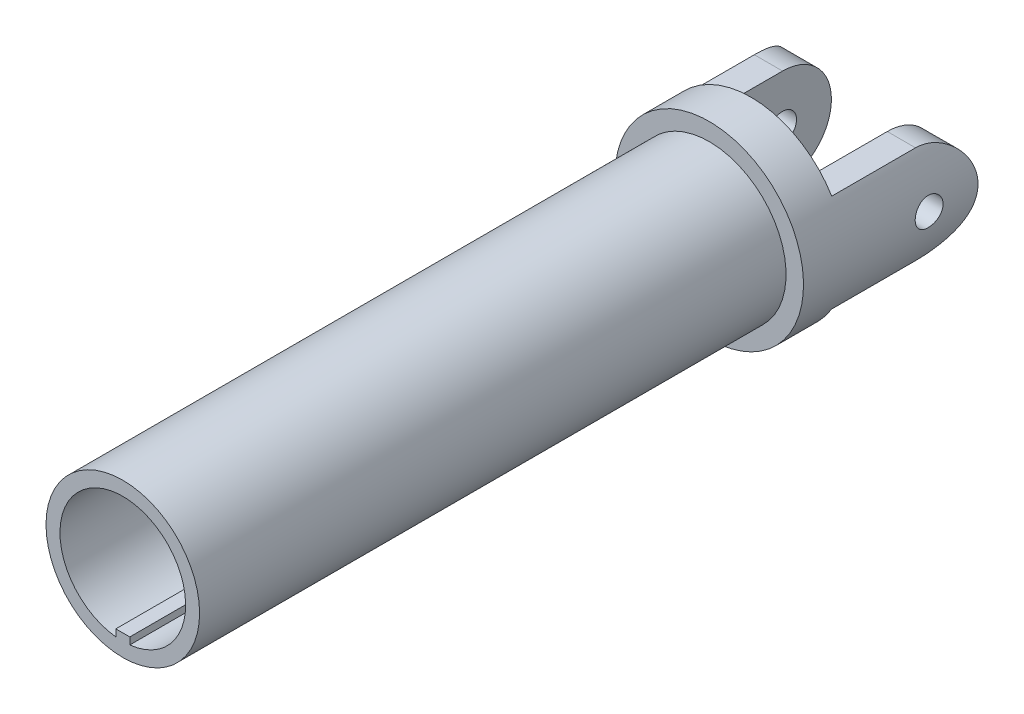
ISO-10303-21;
HEADER;
FILE_DESCRIPTION(('STEP AP214'),'2;1');
FILE_NAME('part.step','',(''),(''),'','','');
FILE_SCHEMA(('AUTOMOTIVE_DESIGN { 1 0 10303 214 1 1 1 1 }'));
ENDSEC;
DATA;
#1=APPLICATION_CONTEXT('core data for automotive mechanical design processes');
#2=APPLICATION_PROTOCOL_DEFINITION('international standard','automotive_design',2000,#1);
#3=PRODUCT_CONTEXT('',#1,'mechanical');
#4=PRODUCT('Part','Part','',(#3));
#5=PRODUCT_RELATED_PRODUCT_CATEGORY('part','',(#4));
#6=PRODUCT_DEFINITION_FORMATION('','',#4);
#7=PRODUCT_DEFINITION_CONTEXT('part definition',#1,'design');
#8=PRODUCT_DEFINITION('design','',#6,#7);
#9=PRODUCT_DEFINITION_SHAPE('','',#8);
#10=(LENGTH_UNIT() NAMED_UNIT(*) SI_UNIT(.MILLI.,.METRE.));
#11=(NAMED_UNIT(*) PLANE_ANGLE_UNIT() SI_UNIT($,.RADIAN.));
#12=(NAMED_UNIT(*) SI_UNIT($,.STERADIAN.) SOLID_ANGLE_UNIT());
#13=UNCERTAINTY_MEASURE_WITH_UNIT(LENGTH_MEASURE(1.E-05),#10,'distance_accuracy_value','');
#14=(GEOMETRIC_REPRESENTATION_CONTEXT(3) GLOBAL_UNCERTAINTY_ASSIGNED_CONTEXT((#13)) GLOBAL_UNIT_ASSIGNED_CONTEXT((#10,
#11,#12)) REPRESENTATION_CONTEXT('',''));
#15=CARTESIAN_POINT('',(0.,0.,0.));
#16=DIRECTION('',(0.,0.,1.));
#17=DIRECTION('',(1.,0.,0.));
#18=AXIS2_PLACEMENT_3D('',#15,#16,#17);
#19=CARTESIAN_POINT('',(0.,0.,-24.));
#20=DIRECTION('',(0.,0.,1.));
#21=DIRECTION('',(1.,0.,0.));
#22=AXIS2_PLACEMENT_3D('',#19,#20,#21);
#23=CYLINDRICAL_SURFACE('',#22,6.75);
#24=CARTESIAN_POINT('',(-6.75,0.,-31.));
#25=CARTESIAN_POINT('',(-6.74999911272059,0.0558425409101657,-30.9999976909739));
#26=CARTESIAN_POINT('',(-6.74929975767196,0.111717684844449,-30.9953066262002));
#27=CARTESIAN_POINT('',(-6.74657719642042,0.221906738606192,-30.9766707451346));
#28=CARTESIAN_POINT('',(-6.74455269374564,0.276219065053058,-30.9627168662834));
#29=CARTESIAN_POINT('',(-6.73940739080019,0.381671836837064,-30.9259809826003));
#30=CARTESIAN_POINT('',(-6.73628741208205,0.432814625447509,-30.9032055921468));
#31=CARTESIAN_POINT('',(-6.72929609307386,0.530544531243023,-30.8494892287142));
#32=CARTESIAN_POINT('',(-6.72542485910577,0.577132291680521,-30.8185494109893));
#33=CARTESIAN_POINT('',(-6.71732864075089,0.66479301775161,-30.7491309350935));
#34=CARTESIAN_POINT('',(-6.71310142384377,0.705826205517572,-30.7106023010483));
#35=CARTESIAN_POINT('',(-6.70478718892022,0.780869855713781,-30.6272074094649));
#36=CARTESIAN_POINT('',(-6.70070017890102,0.81487991810721,-30.5823407911604));
#37=CARTESIAN_POINT('',(-6.69310742202681,0.875066235908764,-30.4872769283577));
#38=CARTESIAN_POINT('',(-6.6896045599627,0.901204098047282,-30.4370551261348));
#39=CARTESIAN_POINT('',(-6.68360711396161,0.944658716040232,-30.3328737482525));
#40=CARTESIAN_POINT('',(-6.68111247643255,0.96197594076768,-30.2789143714423));
#41=CARTESIAN_POINT('',(-6.67743583632494,0.987174376659307,-30.1692074990302));
#42=CARTESIAN_POINT('',(-6.67624437438597,0.995123620308464,-30.1134759525087));
#43=CARTESIAN_POINT('',(-6.67528025275461,1.0015711832689,-30.0014582086667));
#44=CARTESIAN_POINT('',(-6.67550751356993,1.00007003209414,-29.9451720425985));
#45=CARTESIAN_POINT('',(-6.67734650914669,0.987715034694439,-29.834122886774));
#46=CARTESIAN_POINT('',(-6.67894703709383,0.976936892914968,-29.7793512620758));
#47=CARTESIAN_POINT('',(-6.68333472365175,0.946452342629806,-29.6724025809788));
#48=CARTESIAN_POINT('',(-6.68612191507621,0.926745687231395,-29.6202255963716));
#49=CARTESIAN_POINT('',(-6.69258128775432,0.878884561850782,-29.5197165856181));
#50=CARTESIAN_POINT('',(-6.69625682457254,0.85069795915564,-29.4714000851476));
#51=CARTESIAN_POINT('',(-6.70407630948204,0.78669994549834,-29.3801539640613));
#52=CARTESIAN_POINT('',(-6.70822028756469,0.750888046206288,-29.3372246887274));
#53=CARTESIAN_POINT('',(-6.71655927335414,0.672240133725879,-29.2575328147743));
#54=CARTESIAN_POINT('',(-6.7207543845646,0.62933901893079,-29.2208344453194));
#55=CARTESIAN_POINT('',(-6.72868539581363,0.53795254497229,-29.155148804508));
#56=CARTESIAN_POINT('',(-6.73242129392949,0.489467162429428,-29.126161565437));
#57=CARTESIAN_POINT('',(-6.73901671048289,0.38823329363178,-29.0767179850269));
#58=CARTESIAN_POINT('',(-6.74187572726903,0.335482388854871,-29.0562665244811));
#59=CARTESIAN_POINT('',(-6.74639102909035,0.22724304161698,-29.0245304925167));
#60=CARTESIAN_POINT('',(-6.74804739342113,0.171754779898362,-29.0132453167232));
#61=CARTESIAN_POINT('',(-6.74996027662796,0.0601702510974135,-29.000247433234));
#62=CARTESIAN_POINT('',(-6.75022971002842,0.00408448467763341,-28.9984464094182));
#63=CARTESIAN_POINT('',(-6.74937350522533,-0.107588256207567,-29.0042336439311));
#64=CARTESIAN_POINT('',(-6.74824790911938,-0.163175245673516,-29.0118216189294));
#65=CARTESIAN_POINT('',(-6.74473610882736,-0.272005564748215,-29.0360980220436));
#66=CARTESIAN_POINT('',(-6.74235585630278,-0.32525868441956,-29.0527434964207));
#67=CARTESIAN_POINT('',(-6.73660080136599,-0.428218204093146,-29.0946171488986));
#68=CARTESIAN_POINT('',(-6.73322595324427,-0.477924440957681,-29.1198457214687));
#69=CARTESIAN_POINT('',(-6.72582473545489,-0.572768052310924,-29.1783771366065));
#70=CARTESIAN_POINT('',(-6.72179390576589,-0.617870444216266,-29.2117360902563));
#71=CARTESIAN_POINT('',(-6.71354345616816,-0.70186815594721,-29.2855031079937));
#72=CARTESIAN_POINT('',(-6.70932382558081,-0.740763124109862,-29.3259115711788));
#73=CARTESIAN_POINT('',(-6.70113048938946,-0.811562616638171,-29.4130234049341));
#74=CARTESIAN_POINT('',(-6.69715905164284,-0.843407990393647,-29.4597750953769));
#75=CARTESIAN_POINT('',(-6.68995170503097,-0.898793373321402,-29.5580159613304));
#76=CARTESIAN_POINT('',(-6.68671577667948,-0.922333602535498,-29.6095050112808));
#77=CARTESIAN_POINT('',(-6.68136217784517,-0.960348470530136,-29.7155814744695));
#78=CARTESIAN_POINT('',(-6.67924064990097,-0.974854414016819,-29.7701574657212));
#79=CARTESIAN_POINT('',(-6.67634573947977,-0.994488675177338,-29.8810047537763));
#80=CARTESIAN_POINT('',(-6.67557226638415,-0.999617623190394,-29.9372759363674));
#81=CARTESIAN_POINT('',(-6.67546436730878,-1.00033757943703,-30.0493267995347));
#82=CARTESIAN_POINT('',(-6.67611591022978,-0.996021584936615,-30.1051058913773));
#83=CARTESIAN_POINT('',(-6.67875416313144,-0.978173271070795,-30.2151356901121));
#84=CARTESIAN_POINT('',(-6.68074087117957,-0.964640965045214,-30.2693863992164));
#85=CARTESIAN_POINT('',(-6.6858207421393,-0.928776749344402,-30.3747947554377));
#86=CARTESIAN_POINT('',(-6.68891310765919,-0.906451180127706,-30.4259546006592));
#87=CARTESIAN_POINT('',(-6.69585685750153,-0.853643415012499,-30.5238174857813));
#88=CARTESIAN_POINT('',(-6.69970826624953,-0.823160956618997,-30.5705203821881));
#89=CARTESIAN_POINT('',(-6.70778131838235,-0.754566231345791,-30.658616385123));
#90=CARTESIAN_POINT('',(-6.7120060970762,-0.716385046344522,-30.6999555482106));
#91=CARTESIAN_POINT('',(-6.72032356595988,-0.633622295064078,-30.7756731917375));
#92=CARTESIAN_POINT('',(-6.72441622518943,-0.589039241744768,-30.810050050473));
#93=CARTESIAN_POINT('',(-6.73203333976492,-0.494457481821442,-30.8710314318147));
#94=CARTESIAN_POINT('',(-6.73555463068598,-0.444431017911157,-30.897593290153));
#95=CARTESIAN_POINT('',(-6.74160116950649,-0.340598638239511,-30.9418980659904));
#96=CARTESIAN_POINT('',(-6.74412745252672,-0.28679671917619,-30.9596501534456));
#97=CARTESIAN_POINT('',(-6.7473200627825,-0.193958660761502,-30.9817862974269));
#98=CARTESIAN_POINT('',(-6.74831989929762,-0.155496645397279,-30.9886060480908));
#99=CARTESIAN_POINT('',(-6.74966017396957,-0.0780283890929527,-30.9977136790094));
#100=CARTESIAN_POINT('',(-6.75000062002111,-0.0390221546742607,-31.0000016135221));
#101=CARTESIAN_POINT('',(-6.75,0.,-31.));
#102=B_SPLINE_CURVE_WITH_KNOTS('',3,(#24,#25,#26,#27,#28,#29,#30,#31,#32,#33,#34,#35,#36,#37,
#38,#39,#40,#41,#42,#43,#44,#45,#46,#47,#48,#49,#50,#51,#52,#53,#54,#55,#56,#57,#58,#59,#60,#61,
#62,#63,#64,#65,#66,#67,#68,#69,#70,#71,#72,#73,#74,#75,#76,#77,#78,#79,#80,#81,#82,#83,#84,#85,
#86,#87,#88,#89,#90,#91,#92,#93,#94,#95,#96,#97,#98,#99,#100,#101),.UNSPECIFIED.,.T.,.F.,(4,2,2,
2,2,2,2,2,2,2,2,2,2,2,2,2,2,2,2,2,2,2,2,2,2,2,2,2,2,2,2,2,2,2,2,2,2,2,4),(0.,0.167385036095001,
0.33493408033917,0.502357738579202,0.669757719315227,0.838299369512641,1.00685061718639,
1.17621106378315,1.34556250685453,1.51367634882374,1.68178077130974,1.84852625275946,
2.01527634536397,2.18266643054019,2.35006723873285,2.51910075696945,2.6881349829183,
2.85726573135219,3.02638532731912,3.19392726588316,3.36146414868354,3.52821335257178,
3.6949702210977,3.86291226368386,4.03086381714738,4.20017525181088,4.36948220029192,
4.53819917064466,4.70690479910917,4.87395678992066,5.04100853893917,5.20794005372038,
5.37487694113277,5.54338046523498,5.71192319321397,5.88136966036332,6.05063938138702,
6.16760760787006,6.28457443391695),.UNSPECIFIED.);
#103=CARTESIAN_POINT('',(-6.75,0.,-31.));
#104=VERTEX_POINT('',#103);
#105=EDGE_CURVE('E211',#104,#104,#102,.T.);
#106=ORIENTED_EDGE('',*,*,#105,.T.);
#107=EDGE_LOOP('',(#106));
#108=FACE_BOUND('',#107,.T.);
#109=CARTESIAN_POINT('',(6.75,0.,-31.));
#110=CARTESIAN_POINT('',(6.74999911272059,-0.055842540910166,-30.9999976909739));
#111=CARTESIAN_POINT('',(6.74929975767196,-0.111717684844449,-30.9953066262002));
#112=CARTESIAN_POINT('',(6.74657719642042,-0.221906738606192,-30.9766707451346));
#113=CARTESIAN_POINT('',(6.74455269374564,-0.276219065053059,-30.9627168662834));
#114=CARTESIAN_POINT('',(6.73940739080019,-0.381671836837066,-30.9259809826003));
#115=CARTESIAN_POINT('',(6.73628741208205,-0.432814625447512,-30.9032055921468));
#116=CARTESIAN_POINT('',(6.72929609307386,-0.530544531243025,-30.8494892287142));
#117=CARTESIAN_POINT('',(6.72542485910577,-0.577132291680523,-30.8185494109893));
#118=CARTESIAN_POINT('',(6.71732864075089,-0.66479301775161,-30.7491309350935));
#119=CARTESIAN_POINT('',(6.71310142384377,-0.705826205517571,-30.7106023010483));
#120=CARTESIAN_POINT('',(6.70478718892022,-0.78086985571378,-30.6272074094649));
#121=CARTESIAN_POINT('',(6.70070017890102,-0.814879918107209,-30.5823407911604));
#122=CARTESIAN_POINT('',(6.69310742202681,-0.875066235908765,-30.4872769283577));
#123=CARTESIAN_POINT('',(6.6896045599627,-0.901204098047283,-30.4370551261348));
#124=CARTESIAN_POINT('',(6.68360711396162,-0.944658716040233,-30.3328737482525));
#125=CARTESIAN_POINT('',(6.68111247643255,-0.961975940767681,-30.2789143714423));
#126=CARTESIAN_POINT('',(6.67743583632494,-0.987174376659308,-30.1692074990302));
#127=CARTESIAN_POINT('',(6.67624437438597,-0.995123620308465,-30.1134759525087));
#128=CARTESIAN_POINT('',(6.67528025275461,-1.0015711832689,-30.0014582086667));
#129=CARTESIAN_POINT('',(6.67550751356993,-1.00007003209414,-29.9451720425985));
#130=CARTESIAN_POINT('',(6.67734650914669,-0.98771503469444,-29.834122886774));
#131=CARTESIAN_POINT('',(6.67894703709383,-0.976936892914969,-29.7793512620758));
#132=CARTESIAN_POINT('',(6.68333472365175,-0.946452342629807,-29.6724025809788));
#133=CARTESIAN_POINT('',(6.68612191507621,-0.926745687231397,-29.6202255963716));
#134=CARTESIAN_POINT('',(6.69258128775432,-0.878884561850785,-29.5197165856181));
#135=CARTESIAN_POINT('',(6.69625682457254,-0.850697959155643,-29.4714000851476));
#136=CARTESIAN_POINT('',(6.70407630948204,-0.786699945498343,-29.3801539640613));
#137=CARTESIAN_POINT('',(6.70822028756469,-0.75088804620629,-29.3372246887274));
#138=CARTESIAN_POINT('',(6.71655927335414,-0.67224013372588,-29.2575328147743));
#139=CARTESIAN_POINT('',(6.7207543845646,-0.629339018930791,-29.2208344453194));
#140=CARTESIAN_POINT('',(6.72868539581363,-0.537952544972292,-29.155148804508));
#141=CARTESIAN_POINT('',(6.73242129392949,-0.48946716242943,-29.126161565437));
#142=CARTESIAN_POINT('',(6.73901671048289,-0.388233293631784,-29.0767179850269));
#143=CARTESIAN_POINT('',(6.74187572726903,-0.335482388854875,-29.0562665244811));
#144=CARTESIAN_POINT('',(6.74639102909035,-0.227243041616984,-29.0245304925167));
#145=CARTESIAN_POINT('',(6.74804739342113,-0.171754779898365,-29.0132453167232));
#146=CARTESIAN_POINT('',(6.74996027662796,-0.060170251097415,-29.000247433234));
#147=CARTESIAN_POINT('',(6.75022971002842,-0.00408448467763501,-28.9984464094182));
#148=CARTESIAN_POINT('',(6.74937350522533,0.107588256207566,-29.0042336439311));
#149=CARTESIAN_POINT('',(6.74824790911938,0.163175245673515,-29.0118216189294));
#150=CARTESIAN_POINT('',(6.74473610882736,0.272005564748213,-29.0360980220436));
#151=CARTESIAN_POINT('',(6.74235585630278,0.32525868441956,-29.0527434964207));
#152=CARTESIAN_POINT('',(6.736600801366,0.428218204093145,-29.0946171488986));
#153=CARTESIAN_POINT('',(6.73322595324427,0.477924440957679,-29.1198457214687));
#154=CARTESIAN_POINT('',(6.72582473545489,0.572768052310921,-29.1783771366065));
#155=CARTESIAN_POINT('',(6.72179390576589,0.617870444216263,-29.2117360902563));
#156=CARTESIAN_POINT('',(6.71354345616816,0.701868155947209,-29.2855031079937));
#157=CARTESIAN_POINT('',(6.70932382558081,0.740763124109861,-29.3259115711788));
#158=CARTESIAN_POINT('',(6.70113048938946,0.811562616638169,-29.4130234049341));
#159=CARTESIAN_POINT('',(6.69715905164284,0.843407990393646,-29.4597750953769));
#160=CARTESIAN_POINT('',(6.68995170503097,0.898793373321402,-29.5580159613304));
#161=CARTESIAN_POINT('',(6.68671577667948,0.922333602535497,-29.6095050112808));
#162=CARTESIAN_POINT('',(6.68136217784517,0.960348470530135,-29.7155814744695));
#163=CARTESIAN_POINT('',(6.67924064990097,0.974854414016818,-29.7701574657212));
#164=CARTESIAN_POINT('',(6.67634573947977,0.994488675177337,-29.8810047537763));
#165=CARTESIAN_POINT('',(6.67557226638415,0.999617623190393,-29.9372759363674));
#166=CARTESIAN_POINT('',(6.67546436730878,1.00033757943703,-30.0493267995347));
#167=CARTESIAN_POINT('',(6.67611591022978,0.996021584936614,-30.1051058913773));
#168=CARTESIAN_POINT('',(6.67875416313144,0.978173271070794,-30.2151356901121));
#169=CARTESIAN_POINT('',(6.68074087117957,0.964640965045214,-30.2693863992164));
#170=CARTESIAN_POINT('',(6.6858207421393,0.928776749344403,-30.3747947554377));
#171=CARTESIAN_POINT('',(6.68891310765919,0.906451180127706,-30.4259546006592));
#172=CARTESIAN_POINT('',(6.69585685750153,0.853643415012498,-30.5238174857813));
#173=CARTESIAN_POINT('',(6.69970826624953,0.823160956618996,-30.5705203821881));
#174=CARTESIAN_POINT('',(6.70778131838235,0.75456623134579,-30.658616385123));
#175=CARTESIAN_POINT('',(6.7120060970762,0.716385046344521,-30.6999555482106));
#176=CARTESIAN_POINT('',(6.72032356595988,0.633622295064077,-30.7756731917375));
#177=CARTESIAN_POINT('',(6.72441622518943,0.589039241744767,-30.810050050473));
#178=CARTESIAN_POINT('',(6.73203333976492,0.494457481821442,-30.8710314318147));
#179=CARTESIAN_POINT('',(6.73555463068598,0.444431017911156,-30.897593290153));
#180=CARTESIAN_POINT('',(6.74160116950649,0.340598638239509,-30.9418980659904));
#181=CARTESIAN_POINT('',(6.74412745252672,0.286796719176189,-30.9596501534456));
#182=CARTESIAN_POINT('',(6.7473200627825,0.193958660761501,-30.9817862974269));
#183=CARTESIAN_POINT('',(6.74831989929762,0.155496645397279,-30.9886060480908));
#184=CARTESIAN_POINT('',(6.74966017396957,0.0780283890929522,-30.9977136790094));
#185=CARTESIAN_POINT('',(6.75000062002111,0.0390221546742602,-31.0000016135221));
#186=CARTESIAN_POINT('',(6.75,0.,-31.));
#187=B_SPLINE_CURVE_WITH_KNOTS('',3,(#109,#110,#111,#112,#113,#114,#115,#116,#117,#118,#119,
#120,#121,#122,#123,#124,#125,#126,#127,#128,#129,#130,#131,#132,#133,#134,#135,#136,#137,#138,
#139,#140,#141,#142,#143,#144,#145,#146,#147,#148,#149,#150,#151,#152,#153,#154,#155,#156,#157,
#158,#159,#160,#161,#162,#163,#164,#165,#166,#167,#168,#169,#170,#171,#172,#173,#174,#175,#176,
#177,#178,#179,#180,#181,#182,#183,#184,#185,#186),.UNSPECIFIED.,.T.,.F.,(4,2,2,2,2,2,2,2,2,2,2,
2,2,2,2,2,2,2,2,2,2,2,2,2,2,2,2,2,2,2,2,2,2,2,2,2,2,2,4),(0.,0.167385036095001,0.33493408033917,
0.502357738579206,0.669757719315226,0.838299369512639,1.00685061718639,1.17621106378315,
1.34556250685453,1.51367634882374,1.68178077130974,1.84852625275946,2.01527634536397,
2.18266643054019,2.35006723873285,2.51910075696945,2.6881349829183,2.85726573135218,
3.02638532731912,3.19392726588316,3.36146414868354,3.52821335257178,3.69497022109769,
3.86291226368386,4.03086381714738,4.20017525181088,4.36948220029192,4.53819917064465,
4.70690479910917,4.87395678992066,5.04100853893916,5.20794005372038,5.37487694113277,
5.54338046523498,5.71192319321397,5.88136966036332,6.05063938138702,6.16760760787006,
6.28457443391695),.UNSPECIFIED.);
#188=CARTESIAN_POINT('',(6.75,0.,-31.));
#189=VERTEX_POINT('',#188);
#190=EDGE_CURVE('E203',#189,#189,#187,.T.);
#191=ORIENTED_EDGE('',*,*,#190,.T.);
#192=EDGE_LOOP('',(#191));
#193=FACE_BOUND('',#192,.T.);
#194=CARTESIAN_POINT('',(0.,0.,-21.));
#195=DIRECTION('',(0.,0.,-1.));
#196=DIRECTION('',(-1.,0.,0.));
#197=AXIS2_PLACEMENT_3D('',#194,#195,#196);
#198=CIRCLE('',#197,6.75);
#199=CARTESIAN_POINT('',(-6.75,0.,-21.));
#200=VERTEX_POINT('',#199);
#201=EDGE_CURVE('E281',#200,#200,#198,.T.);
#202=ORIENTED_EDGE('',*,*,#201,.T.);
#203=EDGE_LOOP('',(#202));
#204=FACE_BOUND('',#203,.T.);
#205=DIRECTION('',(0.,0.,1.));
#206=VECTOR('',#205,1.);
#207=CARTESIAN_POINT('',(5.7716981903076,-3.5,-33.5));
#208=LINE('',#207,#206);
#209=CARTESIAN_POINT('',(5.7716981903076,-3.5,-30.));
#210=VERTEX_POINT('',#209);
#211=CARTESIAN_POINT('',(5.7716981903076,-3.5,-24.));
#212=VERTEX_POINT('',#211);
#213=EDGE_CURVE('E279',#210,#212,#208,.T.);
#214=ORIENTED_EDGE('',*,*,#213,.F.);
#215=CARTESIAN_POINT('',(5.7716981903076,3.5,-30.));
#216=CARTESIAN_POINT('',(5.77166955421002,3.50001705554504,-30.0911296720306));
#217=CARTESIAN_POINT('',(5.77385573039002,3.49644148706506,-30.1822433063665));
#218=CARTESIAN_POINT('',(5.78244171296421,3.48223957213489,-30.3636602749527));
#219=CARTESIAN_POINT('',(5.78883869884604,3.47161794528503,-30.4539641106151));
#220=CARTESIAN_POINT('',(5.8055794457996,3.44354424311248,-30.6325588453453));
#221=CARTESIAN_POINT('',(5.81589880800477,3.4261343766198,-30.7208586824379));
#222=CARTESIAN_POINT('',(5.8400971794397,3.38472148424651,-30.8953846300326));
#223=CARTESIAN_POINT('',(5.85397664340042,3.36071761608779,-30.981610474084));
#224=CARTESIAN_POINT('',(5.90020187745128,3.27933331417957,-31.235939769041));
#225=CARTESIAN_POINT('',(5.93719387256824,3.21248677463199,-31.4002758228421));
#226=CARTESIAN_POINT('',(6.01931780913164,3.05583264232749,-31.7155181456973));
#227=CARTESIAN_POINT('',(6.06446323301233,2.96598691404088,-31.8664015428341));
#228=CARTESIAN_POINT('',(6.16264056776469,2.75660193180785,-32.1650012631881));
#229=CARTESIAN_POINT('',(6.21601685999561,2.63514101237681,-32.3112609853853));
#230=CARTESIAN_POINT('',(6.32186227552666,2.37001501026078,-32.5824506155107));
#231=CARTESIAN_POINT('',(6.37433103978394,2.22634135335381,-32.7073722474757));
#232=CARTESIAN_POINT('',(6.47713032509302,1.90767178791381,-32.9415319664244));
#233=CARTESIAN_POINT('',(6.52701273178549,1.73114219734409,-33.0489165521625));
#234=CARTESIAN_POINT('',(6.59252243494399,1.45268714248443,-33.1859746896809));
#235=CARTESIAN_POINT('',(6.61280630524951,1.35759448846737,-33.2276568912017));
#236=CARTESIAN_POINT('',(6.64970570263882,1.163471802756,-33.3025976795009));
#237=CARTESIAN_POINT('',(6.66632220054169,1.06444282128917,-33.3358584959144));
#238=CARTESIAN_POINT('',(6.70325793796902,0.808346178347377,-33.4092047876708));
#239=CARTESIAN_POINT('',(6.72066792574392,0.649032894259841,-33.4431472978045));
#240=CARTESIAN_POINT('',(6.74403968155987,0.326492109055723,-33.4885444837744));
#241=CARTESIAN_POINT('',(6.75000510269833,0.163265873799951,-33.5000063354468));
#242=CARTESIAN_POINT('',(6.74999426917082,-0.183363540953697,-33.4999928846737));
#243=CARTESIAN_POINT('',(6.74245762627459,-0.366777079930823,-33.4855203872262));
#244=CARTESIAN_POINT('',(6.71307969249925,-0.727990267216297,-33.4283413782657));
#245=CARTESIAN_POINT('',(6.6912304660912,-0.905786743819561,-33.3856192037591));
#246=CARTESIAN_POINT('',(6.63549697804145,-1.2502132149756,-33.2740853297312));
#247=CARTESIAN_POINT('',(6.60165505000524,-1.41688006807026,-33.2053653441941));
#248=CARTESIAN_POINT('',(6.52498977679903,-1.73608609268259,-33.0443390011146));
#249=CARTESIAN_POINT('',(6.482164616279,-1.88862239967496,-32.9520278754017));
#250=CARTESIAN_POINT('',(6.38822453662089,-2.18607698720936,-32.739804038613));
#251=CARTESIAN_POINT('',(6.33675608268062,-2.32989818981952,-32.6185118676454));
#252=CARTESIAN_POINT('',(6.23239813645147,-2.59619176957678,-32.3547805876641));
#253=CARTESIAN_POINT('',(6.17950732609221,-2.7186434979309,-32.2123212687008));
#254=CARTESIAN_POINT('',(6.07301991608375,-2.94930903512127,-31.8955441184375));
#255=CARTESIAN_POINT('',(6.01975168260832,-3.05540163910414,-31.7195419513625));
#256=CARTESIAN_POINT('',(5.94847215092401,-3.19073390424003,-31.4421572873764));
#257=CARTESIAN_POINT('',(5.92615721445445,-3.23186426667083,-31.3475092158008));
#258=CARTESIAN_POINT('',(5.88523085987807,-3.305804412711,-31.1542678064187));
#259=CARTESIAN_POINT('',(5.86661687095029,-3.33861997647863,-31.0556772647871));
#260=CARTESIAN_POINT('',(5.83770575121213,-3.38885286422883,-30.8786689773139));
#261=CARTESIAN_POINT('',(5.82648140039545,-3.40807647409248,-30.8009085732123));
#262=CARTESIAN_POINT('',(5.80698300904305,-3.44119398640323,-30.643907733566));
#263=CARTESIAN_POINT('',(5.7987082133648,-3.45508925307723,-30.5646676823145));
#264=CARTESIAN_POINT('',(5.7853283424933,-3.47744975957481,-30.4048182151242));
#265=CARTESIAN_POINT('',(5.78023664157441,-3.48589209290093,-30.3242044640658));
#266=CARTESIAN_POINT('',(5.77341130360068,-3.49717450838589,-30.1623968818766));
#267=CARTESIAN_POINT('',(5.77167969418554,-3.50001120785646,-30.0812027301436));
#268=CARTESIAN_POINT('',(5.7716981903076,-3.5,-30.));
#269=B_SPLINE_CURVE_WITH_KNOTS('',3,(#215,#216,#217,#218,#219,#220,#221,#222,#223,#224,#225,
#226,#227,#228,#229,#230,#231,#232,#233,#234,#235,#236,#237,#238,#239,#240,#241,#242,#243,#244,
#245,#246,#247,#248,#249,#250,#251,#252,#253,#254,#255,#256,#257,#258,#259,#260,#261,#262,#263,
#264,#265,#266,#267,#268),.UNSPECIFIED.,.F.,.F.,(4,2,2,2,2,2,2,2,2,2,2,2,2,2,2,2,2,2,2,2,2,2,2,
2,2,2,4),(0.,0.273266457469637,0.546350059803084,0.81776205077936,1.08920872642422,
1.63035056553494,2.17239556411608,2.76231271942997,3.35245815672482,3.98642701695891,
4.30339604861506,4.62028107199127,5.10968645463685,5.59893559342907,6.14841021668935,
6.69818975112102,7.24604761353161,7.7940162950224,8.37674582580402,8.9600353529228,
9.59334043484272,9.90972008307292,10.2258791880275,10.4683092152784,10.7106771311512,
10.9540566679023,11.1975830258738),.UNSPECIFIED.);
#270=CARTESIAN_POINT('',(5.7716981903076,3.5,-30.));
#271=VERTEX_POINT('',#270);
#272=EDGE_CURVE('E244',#271,#210,#269,.T.);
#273=ORIENTED_EDGE('',*,*,#272,.F.);
#274=DIRECTION('',(0.,0.,1.));
#275=VECTOR('',#274,1.);
#276=CARTESIAN_POINT('',(5.7716981903076,3.5,-33.5));
#277=LINE('',#276,#275);
#278=CARTESIAN_POINT('',(5.7716981903076,3.5,-24.));
#279=VERTEX_POINT('',#278);
#280=EDGE_CURVE('E273',#271,#279,#277,.T.);
#281=ORIENTED_EDGE('',*,*,#280,.T.);
#282=CARTESIAN_POINT('',(0.,0.,-24.));
#283=DIRECTION('',(0.,0.,-1.));
#284=DIRECTION('',(-1.,0.,0.));
#285=AXIS2_PLACEMENT_3D('',#282,#283,#284);
#286=CIRCLE('',#285,6.75);
#287=CARTESIAN_POINT('',(-5.7716981903076,3.5,-24.));
#288=VERTEX_POINT('',#287);
#289=EDGE_CURVE('E285',#288,#279,#286,.T.);
#290=ORIENTED_EDGE('',*,*,#289,.F.);
#291=DIRECTION('',(0.,0.,1.));
#292=VECTOR('',#291,1.);
#293=CARTESIAN_POINT('',(-5.7716981903076,3.5,-33.5));
#294=LINE('',#293,#292);
#295=CARTESIAN_POINT('',(-5.7716981903076,3.5,-30.));
#296=VERTEX_POINT('',#295);
#297=EDGE_CURVE('E262',#296,#288,#294,.T.);
#298=ORIENTED_EDGE('',*,*,#297,.F.);
#299=CARTESIAN_POINT('',(-5.7716981903076,-3.5,-30.));
#300=CARTESIAN_POINT('',(-5.77166955421002,-3.50001705554504,-30.0911296720306));
#301=CARTESIAN_POINT('',(-5.77385573039002,-3.49644148706506,-30.1822433063665));
#302=CARTESIAN_POINT('',(-5.78244171296421,-3.48223957213489,-30.3636602749527));
#303=CARTESIAN_POINT('',(-5.78883869884604,-3.47161794528503,-30.4539641106151));
#304=CARTESIAN_POINT('',(-5.8055794457996,-3.44354424311248,-30.6325588453453));
#305=CARTESIAN_POINT('',(-5.81589880800477,-3.4261343766198,-30.7208586824379));
#306=CARTESIAN_POINT('',(-5.8400971794397,-3.38472148424651,-30.8953846300326));
#307=CARTESIAN_POINT('',(-5.85397664340042,-3.36071761608778,-30.981610474084));
#308=CARTESIAN_POINT('',(-5.90020187745128,-3.27933331417957,-31.235939769041));
#309=CARTESIAN_POINT('',(-5.93719387256824,-3.21248677463199,-31.4002758228421));
#310=CARTESIAN_POINT('',(-6.01931780913164,-3.0558326423275,-31.7155181456973));
#311=CARTESIAN_POINT('',(-6.06446323301233,-2.96598691404088,-31.8664015428341));
#312=CARTESIAN_POINT('',(-6.16264056776469,-2.75660193180785,-32.1650012631881));
#313=CARTESIAN_POINT('',(-6.21601685999561,-2.63514101237681,-32.3112609853852));
#314=CARTESIAN_POINT('',(-6.32186227552666,-2.37001501026079,-32.5824506155107));
#315=CARTESIAN_POINT('',(-6.37433103978394,-2.22634135335382,-32.7073722474757));
#316=CARTESIAN_POINT('',(-6.47713032509302,-1.90767178791381,-32.9415319664244));
#317=CARTESIAN_POINT('',(-6.52701273178548,-1.73114219734409,-33.0489165521625));
#318=CARTESIAN_POINT('',(-6.59252243494399,-1.45268714248444,-33.1859746896809));
#319=CARTESIAN_POINT('',(-6.61280630524951,-1.35759448846738,-33.2276568912018));
#320=CARTESIAN_POINT('',(-6.64970570263882,-1.16347180275601,-33.3025976795009));
#321=CARTESIAN_POINT('',(-6.66632220054168,-1.06444282128917,-33.3358584959144));
#322=CARTESIAN_POINT('',(-6.70325793796902,-0.808346178347382,-33.4092047876708));
#323=CARTESIAN_POINT('',(-6.72066792574392,-0.649032894259847,-33.4431472978045));
#324=CARTESIAN_POINT('',(-6.74403968155987,-0.326492109055728,-33.4885444837744));
#325=CARTESIAN_POINT('',(-6.75000510269833,-0.163265873799954,-33.5000063354468));
#326=CARTESIAN_POINT('',(-6.74999426917082,0.183363540953696,-33.4999928846737));
#327=CARTESIAN_POINT('',(-6.74245762627459,0.366777079930822,-33.4855203872262));
#328=CARTESIAN_POINT('',(-6.71307969249925,0.727990267216297,-33.4283413782657));
#329=CARTESIAN_POINT('',(-6.6912304660912,0.905786743819561,-33.3856192037591));
#330=CARTESIAN_POINT('',(-6.63549697804145,1.2502132149756,-33.2740853297312));
#331=CARTESIAN_POINT('',(-6.60165505000524,1.41688006807026,-33.2053653441941));
#332=CARTESIAN_POINT('',(-6.52498977679903,1.73608609268259,-33.0443390011146));
#333=CARTESIAN_POINT('',(-6.482164616279,1.88862239967496,-32.9520278754017));
#334=CARTESIAN_POINT('',(-6.38822453662088,2.18607698720936,-32.739804038613));
#335=CARTESIAN_POINT('',(-6.33675608268062,2.32989818981952,-32.6185118676454));
#336=CARTESIAN_POINT('',(-6.23239813645146,2.59619176957678,-32.3547805876641));
#337=CARTESIAN_POINT('',(-6.17950732609221,2.7186434979309,-32.2123212687008));
#338=CARTESIAN_POINT('',(-6.07301991608375,2.94930903512128,-31.8955441184375));
#339=CARTESIAN_POINT('',(-6.01975168260832,3.05540163910414,-31.7195419513625));
#340=CARTESIAN_POINT('',(-5.94847215092401,3.19073390424003,-31.4421572873763));
#341=CARTESIAN_POINT('',(-5.92615721445445,3.23186426667084,-31.3475092158008));
#342=CARTESIAN_POINT('',(-5.88523085987807,3.305804412711,-31.1542678064187));
#343=CARTESIAN_POINT('',(-5.86661687095029,3.33861997647864,-31.0556772647871));
#344=CARTESIAN_POINT('',(-5.83770575121213,3.38885286422883,-30.8786689773138));
#345=CARTESIAN_POINT('',(-5.82648140039545,3.40807647409248,-30.8009085732122));
#346=CARTESIAN_POINT('',(-5.80698300904305,3.44119398640323,-30.643907733566));
#347=CARTESIAN_POINT('',(-5.7987082133648,3.45508925307723,-30.5646676823145));
#348=CARTESIAN_POINT('',(-5.7853283424933,3.47744975957481,-30.4048182151242));
#349=CARTESIAN_POINT('',(-5.78023664157441,3.48589209290093,-30.3242044640658));
#350=CARTESIAN_POINT('',(-5.77341130360068,3.49717450838588,-30.1623968818766));
#351=CARTESIAN_POINT('',(-5.77167969418554,3.50001120785646,-30.0812027301436));
#352=CARTESIAN_POINT('',(-5.7716981903076,3.5,-30.));
#353=B_SPLINE_CURVE_WITH_KNOTS('',3,(#299,#300,#301,#302,#303,#304,#305,#306,#307,#308,#309,
#310,#311,#312,#313,#314,#315,#316,#317,#318,#319,#320,#321,#322,#323,#324,#325,#326,#327,#328,
#329,#330,#331,#332,#333,#334,#335,#336,#337,#338,#339,#340,#341,#342,#343,#344,#345,#346,#347,
#348,#349,#350,#351,#352),.UNSPECIFIED.,.F.,.F.,(4,2,2,2,2,2,2,2,2,2,2,2,2,2,2,2,2,2,2,2,2,2,2,
2,2,2,4),(0.,0.273266457469637,0.546350059803081,0.817762050779356,1.08920872642422,
1.63035056553493,2.17239556411607,2.76231271942996,3.35245815672481,3.9864270169589,
4.30339604861505,4.62028107199127,5.10968645463684,5.59893559342907,6.14841021668935,
6.69818975112102,7.24604761353161,7.7940162950224,8.37674582580403,8.96003535292281,
9.59334043484273,9.90972008307293,10.2258791880275,10.4683092152785,10.7106771311512,
10.9540566679023,11.1975830258738),.UNSPECIFIED.);
#354=CARTESIAN_POINT('',(-5.7716981903076,-3.5,-30.));
#355=VERTEX_POINT('',#354);
#356=EDGE_CURVE('E237',#355,#296,#353,.T.);
#357=ORIENTED_EDGE('',*,*,#356,.F.);
#358=DIRECTION('',(0.,0.,1.));
#359=VECTOR('',#358,1.);
#360=CARTESIAN_POINT('',(-5.7716981903076,-3.5,-33.5));
#361=LINE('',#360,#359);
#362=CARTESIAN_POINT('',(-5.7716981903076,-3.5,-24.));
#363=VERTEX_POINT('',#362);
#364=EDGE_CURVE('E257',#355,#363,#361,.T.);
#365=ORIENTED_EDGE('',*,*,#364,.T.);
#366=EDGE_CURVE('E282',#212,#363,#286,.T.);
#367=ORIENTED_EDGE('',*,*,#366,.F.);
#368=EDGE_LOOP('',(#214,#273,#281,#290,#298,#357,#365,#367));
#369=FACE_BOUND('',#368,.T.);
#370=ADVANCED_FACE('F70',(#108,#193,#204,#369),#23,.T.);
#371=CARTESIAN_POINT('',(3.75,3.5,-33.5));
#372=DIRECTION('',(1.,0.,0.));
#373=DIRECTION('',(0.,0.,-1.));
#374=AXIS2_PLACEMENT_3D('',#371,#372,#373);
#375=PLANE('',#374);
#376=CARTESIAN_POINT('',(3.75,0.,-30.));
#377=DIRECTION('',(1.,0.,0.));
#378=DIRECTION('',(0.,0.,-1.));
#379=AXIS2_PLACEMENT_3D('',#376,#377,#378);
#380=CIRCLE('',#379,1.);
#381=CARTESIAN_POINT('',(3.75,0.,-31.));
#382=VERTEX_POINT('',#381);
#383=EDGE_CURVE('E200',#382,#382,#380,.T.);
#384=ORIENTED_EDGE('',*,*,#383,.T.);
#385=EDGE_LOOP('',(#384));
#386=FACE_BOUND('',#385,.T.);
#387=CARTESIAN_POINT('',(3.75,0.,-30.));
#388=DIRECTION('',(1.,0.,0.));
#389=DIRECTION('',(0.,0.,-1.));
#390=AXIS2_PLACEMENT_3D('',#387,#388,#389);
#391=CIRCLE('',#390,3.5);
#392=CARTESIAN_POINT('',(3.75,-3.5,-30.));
#393=VERTEX_POINT('',#392);
#394=CARTESIAN_POINT('',(3.75,3.5,-30.));
#395=VERTEX_POINT('',#394);
#396=EDGE_CURVE('E341',#393,#395,#391,.T.);
#397=ORIENTED_EDGE('',*,*,#396,.F.);
#398=DIRECTION('',(0.,0.,1.));
#399=VECTOR('',#398,1.);
#400=CARTESIAN_POINT('',(3.75,-3.5,-33.5));
#401=LINE('',#400,#399);
#402=CARTESIAN_POINT('',(3.75,-3.5,-24.));
#403=VERTEX_POINT('',#402);
#404=EDGE_CURVE('E277',#393,#403,#401,.T.);
#405=ORIENTED_EDGE('',*,*,#404,.T.);
#406=DIRECTION('',(0.,1.,0.));
#407=VECTOR('',#406,1.);
#408=CARTESIAN_POINT('',(3.75,3.5,-24.));
#409=LINE('',#408,#407);
#410=CARTESIAN_POINT('',(3.75,3.5,-24.));
#411=VERTEX_POINT('',#410);
#412=EDGE_CURVE('E267',#403,#411,#409,.T.);
#413=ORIENTED_EDGE('',*,*,#412,.T.);
#414=DIRECTION('',(0.,0.,1.));
#415=VECTOR('',#414,1.);
#416=CARTESIAN_POINT('',(3.75,3.5,-33.5));
#417=LINE('',#416,#415);
#418=EDGE_CURVE('E275',#395,#411,#417,.T.);
#419=ORIENTED_EDGE('',*,*,#418,.F.);
#420=EDGE_LOOP('',(#397,#405,#413,#419));
#421=FACE_BOUND('',#420,.T.);
#422=ADVANCED_FACE('F308',(#386,#421),#375,.F.);
#423=CARTESIAN_POINT('',(-3.75,-3.5,-33.5));
#424=DIRECTION('',(-1.,0.,0.));
#425=DIRECTION('',(0.,-1.,0.));
#426=AXIS2_PLACEMENT_3D('',#423,#424,#425);
#427=PLANE('',#426);
#428=CARTESIAN_POINT('',(-3.75,0.,-30.));
#429=DIRECTION('',(-1.,0.,0.));
#430=DIRECTION('',(0.,-1.,0.));
#431=AXIS2_PLACEMENT_3D('',#428,#429,#430);
#432=CIRCLE('',#431,1.);
#433=CARTESIAN_POINT('',(-3.75,-1.,-30.));
#434=VERTEX_POINT('',#433);
#435=EDGE_CURVE('E74',#434,#434,#432,.T.);
#436=ORIENTED_EDGE('',*,*,#435,.T.);
#437=EDGE_LOOP('',(#436));
#438=FACE_BOUND('',#437,.T.);
#439=DIRECTION('',(0.,0.,1.));
#440=VECTOR('',#439,1.);
#441=CARTESIAN_POINT('',(-3.75,-3.5,-33.5));
#442=LINE('',#441,#440);
#443=CARTESIAN_POINT('',(-3.75,-3.5,-30.));
#444=VERTEX_POINT('',#443);
#445=CARTESIAN_POINT('',(-3.75,-3.5,-24.));
#446=VERTEX_POINT('',#445);
#447=EDGE_CURVE('E94',#444,#446,#442,.T.);
#448=ORIENTED_EDGE('',*,*,#447,.F.);
#449=CARTESIAN_POINT('',(-3.75,0.,-30.));
#450=DIRECTION('',(-1.,0.,0.));
#451=DIRECTION('',(0.,-1.,0.));
#452=AXIS2_PLACEMENT_3D('',#449,#450,#451);
#453=CIRCLE('',#452,3.5);
#454=CARTESIAN_POINT('',(-3.75,3.5,-30.));
#455=VERTEX_POINT('',#454);
#456=EDGE_CURVE('E343',#455,#444,#453,.T.);
#457=ORIENTED_EDGE('',*,*,#456,.F.);
#458=DIRECTION('',(0.,0.,1.));
#459=VECTOR('',#458,1.);
#460=CARTESIAN_POINT('',(-3.75,3.5,-33.5));
#461=LINE('',#460,#459);
#462=CARTESIAN_POINT('',(-3.75,3.5,-24.));
#463=VERTEX_POINT('',#462);
#464=EDGE_CURVE('E260',#455,#463,#461,.T.);
#465=ORIENTED_EDGE('',*,*,#464,.T.);
#466=DIRECTION('',(0.,-1.,0.));
#467=VECTOR('',#466,1.);
#468=CARTESIAN_POINT('',(-3.75,-3.5,-24.));
#469=LINE('',#468,#467);
#470=EDGE_CURVE('E253',#463,#446,#469,.T.);
#471=ORIENTED_EDGE('',*,*,#470,.T.);
#472=EDGE_LOOP('',(#448,#457,#465,#471));
#473=FACE_BOUND('',#472,.T.);
#474=ADVANCED_FACE('F313',(#438,#473),#427,.F.);
#475=CARTESIAN_POINT('',(5.7716981903076,3.5,-33.5));
#476=DIRECTION('',(0.,-1.,0.));
#477=DIRECTION('',(1.,0.,0.));
#478=AXIS2_PLACEMENT_3D('',#475,#476,#477);
#479=PLANE('',#478);
#480=DIRECTION('',(1.,0.,0.));
#481=VECTOR('',#480,1.);
#482=CARTESIAN_POINT('',(-6.75,3.5,-30.));
#483=LINE('',#482,#481);
#484=EDGE_CURVE('E345',#395,#271,#483,.T.);
#485=ORIENTED_EDGE('',*,*,#484,.F.);
#486=ORIENTED_EDGE('',*,*,#418,.T.);
#487=DIRECTION('',(1.,0.,0.));
#488=VECTOR('',#487,1.);
#489=CARTESIAN_POINT('',(5.7716981903076,3.5,-24.));
#490=LINE('',#489,#488);
#491=EDGE_CURVE('E270',#411,#279,#490,.T.);
#492=ORIENTED_EDGE('',*,*,#491,.T.);
#493=ORIENTED_EDGE('',*,*,#280,.F.);
#494=EDGE_LOOP('',(#485,#486,#492,#493));
#495=FACE_BOUND('',#494,.T.);
#496=ADVANCED_FACE('F361',(#495),#479,.F.);
#497=CARTESIAN_POINT('',(-3.75,3.5,-33.5));
#498=DIRECTION('',(0.,-1.,0.));
#499=DIRECTION('',(0.,0.,-1.));
#500=AXIS2_PLACEMENT_3D('',#497,#498,#499);
#501=PLANE('',#500);
#502=EDGE_CURVE('E348',#296,#455,#483,.T.);
#503=ORIENTED_EDGE('',*,*,#502,.F.);
#504=ORIENTED_EDGE('',*,*,#297,.T.);
#505=DIRECTION('',(1.,0.,0.));
#506=VECTOR('',#505,1.);
#507=CARTESIAN_POINT('',(-3.75,3.5,-24.));
#508=LINE('',#507,#506);
#509=EDGE_CURVE('E250',#288,#463,#508,.T.);
#510=ORIENTED_EDGE('',*,*,#509,.T.);
#511=ORIENTED_EDGE('',*,*,#464,.F.);
#512=EDGE_LOOP('',(#503,#504,#510,#511));
#513=FACE_BOUND('',#512,.T.);
#514=ADVANCED_FACE('F303',(#513),#501,.F.);
#515=CARTESIAN_POINT('',(0.,0.,-24.));
#516=DIRECTION('',(0.,0.,-1.));
#517=DIRECTION('',(-1.,0.,0.));
#518=AXIS2_PLACEMENT_3D('',#515,#516,#517);
#519=PLANE('',#518);
#520=ORIENTED_EDGE('',*,*,#470,.F.);
#521=ORIENTED_EDGE('',*,*,#509,.F.);
#522=ORIENTED_EDGE('',*,*,#289,.T.);
#523=ORIENTED_EDGE('',*,*,#491,.F.);
#524=ORIENTED_EDGE('',*,*,#412,.F.);
#525=DIRECTION('',(-1.,0.,0.));
#526=VECTOR('',#525,1.);
#527=CARTESIAN_POINT('',(3.75,-3.5,-24.));
#528=LINE('',#527,#526);
#529=EDGE_CURVE('E264',#212,#403,#528,.T.);
#530=ORIENTED_EDGE('',*,*,#529,.F.);
#531=ORIENTED_EDGE('',*,*,#366,.T.);
#532=DIRECTION('',(-1.,0.,0.));
#533=VECTOR('',#532,1.);
#534=CARTESIAN_POINT('',(-5.7716981903076,-3.5,-24.));
#535=LINE('',#534,#533);
#536=EDGE_CURVE('E255',#446,#363,#535,.T.);
#537=ORIENTED_EDGE('',*,*,#536,.F.);
#538=EDGE_LOOP('',(#520,#521,#522,#523,#524,#530,#531,#537));
#539=FACE_BOUND('',#538,.T.);
#540=ADVANCED_FACE('F296',(#539),#519,.T.);
#541=CARTESIAN_POINT('',(0.,0.,21.));
#542=DIRECTION('',(0.,0.,-1.));
#543=DIRECTION('',(-1.,0.,0.));
#544=AXIS2_PLACEMENT_3D('',#541,#542,#543);
#545=CYLINDRICAL_SURFACE('',#544,5.5);
#546=CARTESIAN_POINT('',(0.,0.,21.));
#547=DIRECTION('',(0.,0.,1.));
#548=DIRECTION('',(1.,0.,0.));
#549=AXIS2_PLACEMENT_3D('',#546,#547,#548);
#550=CIRCLE('',#549,5.5);
#551=CARTESIAN_POINT('',(5.5,0.,21.));
#552=VERTEX_POINT('',#551);
#553=EDGE_CURVE('E12',#552,#552,#550,.T.);
#554=ORIENTED_EDGE('',*,*,#553,.F.);
#555=EDGE_LOOP('',(#554));
#556=FACE_BOUND('',#555,.T.);
#557=CARTESIAN_POINT('',(0.,0.,-21.));
#558=DIRECTION('',(0.,0.,-1.));
#559=DIRECTION('',(-1.,0.,0.));
#560=AXIS2_PLACEMENT_3D('',#557,#558,#559);
#561=CIRCLE('',#560,5.5);
#562=CARTESIAN_POINT('',(-5.5,0.,-21.));
#563=VERTEX_POINT('',#562);
#564=EDGE_CURVE('E79',#563,#563,#561,.T.);
#565=ORIENTED_EDGE('',*,*,#564,.F.);
#566=EDGE_LOOP('',(#565));
#567=FACE_BOUND('',#566,.T.);
#568=ADVANCED_FACE('F72',(#556,#567),#545,.T.);
#569=CARTESIAN_POINT('',(0.,0.,21.));
#570=DIRECTION('',(0.,0.,1.));
#571=DIRECTION('',(1.,0.,0.));
#572=AXIS2_PLACEMENT_3D('',#569,#570,#571);
#573=PLANE('',#572);
#574=CARTESIAN_POINT('',(0.,0.,21.));
#575=DIRECTION('',(0.,0.,1.));
#576=DIRECTION('',(1.,0.,0.));
#577=AXIS2_PLACEMENT_3D('',#574,#575,#576);
#578=CIRCLE('',#577,4.5);
#579=CARTESIAN_POINT('',(0.5,-4.47213595499958,21.));
#580=VERTEX_POINT('',#579);
#581=CARTESIAN_POINT('',(-0.5,-4.47213595499958,21.));
#582=VERTEX_POINT('',#581);
#583=EDGE_CURVE('E86',#580,#582,#578,.T.);
#584=ORIENTED_EDGE('',*,*,#583,.F.);
#585=DIRECTION('',(0.,-1.,0.));
#586=VECTOR('',#585,1.);
#587=CARTESIAN_POINT('',(0.5,-4.47213595499958,21.));
#588=LINE('',#587,#586);
#589=CARTESIAN_POINT('',(0.5,-3.97213595499958,21.));
#590=VERTEX_POINT('',#589);
#591=EDGE_CURVE('E182',#590,#580,#588,.T.);
#592=ORIENTED_EDGE('',*,*,#591,.F.);
#593=DIRECTION('',(1.,0.,0.));
#594=VECTOR('',#593,1.);
#595=CARTESIAN_POINT('',(0.5,-3.97213595499958,21.));
#596=LINE('',#595,#594);
#597=CARTESIAN_POINT('',(-0.5,-3.97213595499958,21.));
#598=VERTEX_POINT('',#597);
#599=EDGE_CURVE('E185',#598,#590,#596,.T.);
#600=ORIENTED_EDGE('',*,*,#599,.F.);
#601=DIRECTION('',(0.,1.,0.));
#602=VECTOR('',#601,1.);
#603=CARTESIAN_POINT('',(-0.5,-3.97213595499958,21.));
#604=LINE('',#603,#602);
#605=EDGE_CURVE('E191',#582,#598,#604,.T.);
#606=ORIENTED_EDGE('',*,*,#605,.F.);
#607=EDGE_LOOP('',(#584,#592,#600,#606));
#608=FACE_BOUND('',#607,.T.);
#609=ORIENTED_EDGE('',*,*,#553,.T.);
#610=EDGE_LOOP('',(#609));
#611=FACE_BOUND('',#610,.T.);
#612=ADVANCED_FACE('F295',(#608,#611),#573,.T.);
#613=CARTESIAN_POINT('',(0.,0.,-21.));
#614=DIRECTION('',(0.,0.,-1.));
#615=DIRECTION('',(-1.,0.,0.));
#616=AXIS2_PLACEMENT_3D('',#613,#614,#615);
#617=PLANE('',#616);
#618=ORIENTED_EDGE('',*,*,#564,.T.);
#619=EDGE_LOOP('',(#618));
#620=FACE_BOUND('',#619,.T.);
#621=ORIENTED_EDGE('',*,*,#201,.F.);
#622=EDGE_LOOP('',(#621));
#623=FACE_BOUND('',#622,.T.);
#624=ADVANCED_FACE('F291',(#620,#623),#617,.F.);
#625=CARTESIAN_POINT('',(3.75,-3.5,-33.5));
#626=DIRECTION('',(0.,1.,0.));
#627=DIRECTION('',(-1.,0.,0.));
#628=AXIS2_PLACEMENT_3D('',#625,#626,#627);
#629=PLANE('',#628);
#630=ORIENTED_EDGE('',*,*,#404,.F.);
#631=DIRECTION('',(1.,0.,0.));
#632=VECTOR('',#631,1.);
#633=CARTESIAN_POINT('',(-6.75,-3.5,-30.));
#634=LINE('',#633,#632);
#635=EDGE_CURVE('E333',#393,#210,#634,.T.);
#636=ORIENTED_EDGE('',*,*,#635,.T.);
#637=ORIENTED_EDGE('',*,*,#213,.T.);
#638=ORIENTED_EDGE('',*,*,#529,.T.);
#639=EDGE_LOOP('',(#630,#636,#637,#638));
#640=FACE_BOUND('',#639,.T.);
#641=ADVANCED_FACE('F331',(#640),#629,.F.);
#642=CARTESIAN_POINT('',(-5.7716981903076,-3.5,-33.5));
#643=DIRECTION('',(0.,1.,0.));
#644=DIRECTION('',(0.,0.,1.));
#645=AXIS2_PLACEMENT_3D('',#642,#643,#644);
#646=PLANE('',#645);
#647=ORIENTED_EDGE('',*,*,#364,.F.);
#648=EDGE_CURVE('E344',#355,#444,#634,.T.);
#649=ORIENTED_EDGE('',*,*,#648,.T.);
#650=ORIENTED_EDGE('',*,*,#447,.T.);
#651=ORIENTED_EDGE('',*,*,#536,.T.);
#652=EDGE_LOOP('',(#647,#649,#650,#651));
#653=FACE_BOUND('',#652,.T.);
#654=ADVANCED_FACE('F233',(#653),#646,.F.);
#655=CARTESIAN_POINT('',(-6.75,0.,-30.));
#656=DIRECTION('',(1.,0.,0.));
#657=DIRECTION('',(0.,0.,-1.));
#658=AXIS2_PLACEMENT_3D('',#655,#656,#657);
#659=CYLINDRICAL_SURFACE('',#658,3.5);
#660=ORIENTED_EDGE('',*,*,#356,.T.);
#661=ORIENTED_EDGE('',*,*,#502,.T.);
#662=ORIENTED_EDGE('',*,*,#456,.T.);
#663=ORIENTED_EDGE('',*,*,#648,.F.);
#664=EDGE_LOOP('',(#660,#661,#662,#663));
#665=FACE_BOUND('',#664,.T.);
#666=ADVANCED_FACE('F231',(#665),#659,.T.);
#667=ORIENTED_EDGE('',*,*,#272,.T.);
#668=ORIENTED_EDGE('',*,*,#635,.F.);
#669=ORIENTED_EDGE('',*,*,#396,.T.);
#670=ORIENTED_EDGE('',*,*,#484,.T.);
#671=EDGE_LOOP('',(#667,#668,#669,#670));
#672=FACE_BOUND('',#671,.T.);
#673=ADVANCED_FACE('F224',(#672),#659,.T.);
#674=CARTESIAN_POINT('',(-6.75,0.,-30.));
#675=DIRECTION('',(1.,0.,0.));
#676=DIRECTION('',(0.,0.,-1.));
#677=AXIS2_PLACEMENT_3D('',#674,#675,#676);
#678=CYLINDRICAL_SURFACE('',#677,1.);
#679=ORIENTED_EDGE('',*,*,#435,.F.);
#680=EDGE_LOOP('',(#679));
#681=FACE_BOUND('',#680,.T.);
#682=ORIENTED_EDGE('',*,*,#105,.F.);
#683=EDGE_LOOP('',(#682));
#684=FACE_BOUND('',#683,.T.);
#685=ADVANCED_FACE('F218',(#681,#684),#678,.F.);
#686=ORIENTED_EDGE('',*,*,#383,.F.);
#687=EDGE_LOOP('',(#686));
#688=FACE_BOUND('',#687,.T.);
#689=ORIENTED_EDGE('',*,*,#190,.F.);
#690=EDGE_LOOP('',(#689));
#691=FACE_BOUND('',#690,.T.);
#692=ADVANCED_FACE('F223',(#688,#691),#678,.F.);
#693=CARTESIAN_POINT('',(0.,0.,-21.));
#694=DIRECTION('',(0.,0.,1.));
#695=DIRECTION('',(1.,0.,0.));
#696=AXIS2_PLACEMENT_3D('',#693,#694,#695);
#697=CYLINDRICAL_SURFACE('',#696,4.5);
#698=ORIENTED_EDGE('',*,*,#583,.T.);
#699=DIRECTION('',(0.,0.,1.));
#700=VECTOR('',#699,1.);
#701=CARTESIAN_POINT('',(-0.5,-4.47213595499958,-21.));
#702=LINE('',#701,#700);
#703=CARTESIAN_POINT('',(-0.5,-4.47213595499958,-21.));
#704=VERTEX_POINT('',#703);
#705=EDGE_CURVE('E160',#704,#582,#702,.T.);
#706=ORIENTED_EDGE('',*,*,#705,.F.);
#707=CARTESIAN_POINT('',(0.,0.,-21.));
#708=DIRECTION('',(0.,0.,1.));
#709=DIRECTION('',(1.,0.,0.));
#710=AXIS2_PLACEMENT_3D('',#707,#708,#709);
#711=CIRCLE('',#710,4.5);
#712=CARTESIAN_POINT('',(0.5,-4.47213595499958,-21.));
#713=VERTEX_POINT('',#712);
#714=EDGE_CURVE('E164',#713,#704,#711,.T.);
#715=ORIENTED_EDGE('',*,*,#714,.F.);
#716=DIRECTION('',(0.,0.,1.));
#717=VECTOR('',#716,1.);
#718=CARTESIAN_POINT('',(0.5,-4.47213595499958,-21.));
#719=LINE('',#718,#717);
#720=EDGE_CURVE('E195',#713,#580,#719,.T.);
#721=ORIENTED_EDGE('',*,*,#720,.T.);
#722=EDGE_LOOP('',(#698,#706,#715,#721));
#723=FACE_BOUND('',#722,.T.);
#724=ADVANCED_FACE('F162',(#723),#697,.F.);
#725=CARTESIAN_POINT('',(0.5,-4.47213595499958,-21.));
#726=DIRECTION('',(-1.,0.,0.));
#727=DIRECTION('',(0.,-1.,0.));
#728=AXIS2_PLACEMENT_3D('',#725,#726,#727);
#729=PLANE('',#728);
#730=ORIENTED_EDGE('',*,*,#591,.T.);
#731=ORIENTED_EDGE('',*,*,#720,.F.);
#732=DIRECTION('',(0.,-1.,0.));
#733=VECTOR('',#732,1.);
#734=CARTESIAN_POINT('',(0.5,-4.47213595499958,-21.));
#735=LINE('',#734,#733);
#736=CARTESIAN_POINT('',(0.5,-3.97213595499958,-21.));
#737=VERTEX_POINT('',#736);
#738=EDGE_CURVE('E170',#737,#713,#735,.T.);
#739=ORIENTED_EDGE('',*,*,#738,.F.);
#740=DIRECTION('',(0.,0.,1.));
#741=VECTOR('',#740,1.);
#742=CARTESIAN_POINT('',(0.5,-3.97213595499958,-21.));
#743=LINE('',#742,#741);
#744=EDGE_CURVE('E197',#737,#590,#743,.T.);
#745=ORIENTED_EDGE('',*,*,#744,.T.);
#746=EDGE_LOOP('',(#730,#731,#739,#745));
#747=FACE_BOUND('',#746,.T.);
#748=ADVANCED_FACE('F414',(#747),#729,.F.);
#749=CARTESIAN_POINT('',(0.5,-3.97213595499958,-21.));
#750=DIRECTION('',(0.,-1.,0.));
#751=DIRECTION('',(0.,0.,-1.));
#752=AXIS2_PLACEMENT_3D('',#749,#750,#751);
#753=PLANE('',#752);
#754=ORIENTED_EDGE('',*,*,#599,.T.);
#755=ORIENTED_EDGE('',*,*,#744,.F.);
#756=DIRECTION('',(1.,0.,0.));
#757=VECTOR('',#756,1.);
#758=CARTESIAN_POINT('',(0.5,-3.97213595499958,-21.));
#759=LINE('',#758,#757);
#760=CARTESIAN_POINT('',(-0.5,-3.97213595499958,-21.));
#761=VERTEX_POINT('',#760);
#762=EDGE_CURVE('E178',#761,#737,#759,.T.);
#763=ORIENTED_EDGE('',*,*,#762,.F.);
#764=DIRECTION('',(0.,0.,1.));
#765=VECTOR('',#764,1.);
#766=CARTESIAN_POINT('',(-0.5,-3.97213595499958,-21.));
#767=LINE('',#766,#765);
#768=EDGE_CURVE('E169',#761,#598,#767,.T.);
#769=ORIENTED_EDGE('',*,*,#768,.T.);
#770=EDGE_LOOP('',(#754,#755,#763,#769));
#771=FACE_BOUND('',#770,.T.);
#772=ADVANCED_FACE('F420',(#771),#753,.F.);
#773=CARTESIAN_POINT('',(-0.5,-3.97213595499958,-21.));
#774=DIRECTION('',(1.,0.,0.));
#775=DIRECTION('',(0.,1.,0.));
#776=AXIS2_PLACEMENT_3D('',#773,#774,#775);
#777=PLANE('',#776);
#778=ORIENTED_EDGE('',*,*,#605,.T.);
#779=ORIENTED_EDGE('',*,*,#768,.F.);
#780=DIRECTION('',(0.,1.,0.));
#781=VECTOR('',#780,1.);
#782=CARTESIAN_POINT('',(-0.5,-3.97213595499958,-21.));
#783=LINE('',#782,#781);
#784=EDGE_CURVE('E173',#704,#761,#783,.T.);
#785=ORIENTED_EDGE('',*,*,#784,.F.);
#786=ORIENTED_EDGE('',*,*,#705,.T.);
#787=EDGE_LOOP('',(#778,#779,#785,#786));
#788=FACE_BOUND('',#787,.T.);
#789=ADVANCED_FACE('F174',(#788),#777,.F.);
#790=CARTESIAN_POINT('',(0.,0.,-21.));
#791=DIRECTION('',(0.,0.,1.));
#792=DIRECTION('',(1.,0.,0.));
#793=AXIS2_PLACEMENT_3D('',#790,#791,#792);
#794=PLANE('',#793);
#795=ORIENTED_EDGE('',*,*,#714,.T.);
#796=ORIENTED_EDGE('',*,*,#784,.T.);
#797=ORIENTED_EDGE('',*,*,#762,.T.);
#798=ORIENTED_EDGE('',*,*,#738,.T.);
#799=EDGE_LOOP('',(#795,#796,#797,#798));
#800=FACE_BOUND('',#799,.T.);
#801=ADVANCED_FACE('F180',(#800),#794,.T.);
#802=CLOSED_SHELL('',(#370,#422,#474,#496,#514,#540,#568,#612,#624,#641,#654,#666,#673,#685,
#692,#724,#748,#772,#789,#801));
#803=MANIFOLD_SOLID_BREP('B2',#802);
#804=ADVANCED_BREP_SHAPE_REPRESENTATION('',(#18,#803),#14);
#805=SHAPE_DEFINITION_REPRESENTATION(#9,#804);
ENDSEC;
END-ISO-10303-21;
